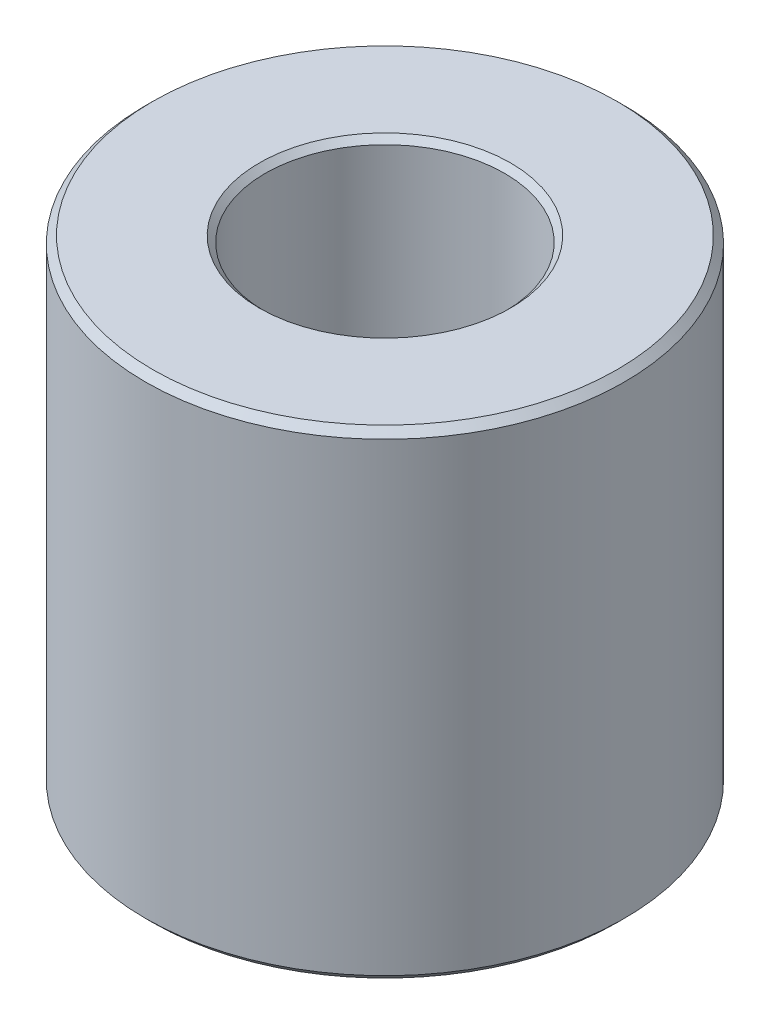
ISO-10303-21;
HEADER;
FILE_DESCRIPTION(('STEP AP214'),'2;1');
FILE_NAME('part.step','',(''),(''),'','','');
FILE_SCHEMA(('AUTOMOTIVE_DESIGN { 1 0 10303 214 1 1 1 1 }'));
ENDSEC;
DATA;
#1=APPLICATION_CONTEXT('core data for automotive mechanical design processes');
#2=APPLICATION_PROTOCOL_DEFINITION('international standard','automotive_design',2000,#1);
#3=PRODUCT_CONTEXT('',#1,'mechanical');
#4=PRODUCT('Part','Part','',(#3));
#5=PRODUCT_RELATED_PRODUCT_CATEGORY('part','',(#4));
#6=PRODUCT_DEFINITION_FORMATION('','',#4);
#7=PRODUCT_DEFINITION_CONTEXT('part definition',#1,'design');
#8=PRODUCT_DEFINITION('design','',#6,#7);
#9=PRODUCT_DEFINITION_SHAPE('','',#8);
#10=(LENGTH_UNIT() NAMED_UNIT(*) SI_UNIT(.MILLI.,.METRE.));
#11=(NAMED_UNIT(*) PLANE_ANGLE_UNIT() SI_UNIT($,.RADIAN.));
#12=(NAMED_UNIT(*) SI_UNIT($,.STERADIAN.) SOLID_ANGLE_UNIT());
#13=UNCERTAINTY_MEASURE_WITH_UNIT(LENGTH_MEASURE(1.E-05),#10,'distance_accuracy_value','');
#14=(GEOMETRIC_REPRESENTATION_CONTEXT(3) GLOBAL_UNCERTAINTY_ASSIGNED_CONTEXT((#13)) GLOBAL_UNIT_ASSIGNED_CONTEXT((#10,
#11,#12)) REPRESENTATION_CONTEXT('',''));
#15=CARTESIAN_POINT('',(0.,0.,0.));
#16=DIRECTION('',(0.,0.,1.));
#17=DIRECTION('',(1.,0.,0.));
#18=AXIS2_PLACEMENT_3D('',#15,#16,#17);
#19=CARTESIAN_POINT('',(0.,50.8,0.));
#20=DIRECTION('',(0.,-1.,0.));
#21=DIRECTION('',(0.,0.,-1.));
#22=AXIS2_PLACEMENT_3D('',#19,#20,#21);
#23=CYLINDRICAL_SURFACE('',#22,25.4);
#24=CARTESIAN_POINT('',(0.,0.761999999999985,0.));
#25=DIRECTION('',(0.,1.,0.));
#26=DIRECTION('',(0.,0.,1.));
#27=AXIS2_PLACEMENT_3D('',#24,#25,#26);
#28=CIRCLE('',#27,25.4);
#29=CARTESIAN_POINT('',(0.,0.761999999999985,25.4000000000001));
#30=VERTEX_POINT('',#29);
#31=EDGE_CURVE('E57',#30,#30,#28,.T.);
#32=ORIENTED_EDGE('',*,*,#31,.T.);
#33=EDGE_LOOP('',(#32));
#34=FACE_BOUND('',#33,.T.);
#35=CARTESIAN_POINT('',(0.,50.038,0.));
#36=DIRECTION('',(0.,1.,0.));
#37=DIRECTION('',(0.,0.,1.));
#38=AXIS2_PLACEMENT_3D('',#35,#36,#37);
#39=CIRCLE('',#38,25.4);
#40=CARTESIAN_POINT('',(0.,50.038,25.4000000000001));
#41=VERTEX_POINT('',#40);
#42=EDGE_CURVE('E60',#41,#41,#39,.F.);
#43=ORIENTED_EDGE('',*,*,#42,.T.);
#44=EDGE_LOOP('',(#43));
#45=FACE_BOUND('',#44,.T.);
#46=ADVANCED_FACE('F30',(#34,#45),#23,.T.);
#47=CARTESIAN_POINT('',(0.,50.8,0.));
#48=DIRECTION('',(0.,1.,0.));
#49=DIRECTION('',(0.,0.,1.));
#50=AXIS2_PLACEMENT_3D('',#47,#48,#49);
#51=PLANE('',#50);
#52=CARTESIAN_POINT('',(0.,50.8,0.));
#53=DIRECTION('',(0.,1.,0.));
#54=DIRECTION('',(0.,0.,1.));
#55=AXIS2_PLACEMENT_3D('',#52,#53,#54);
#56=CIRCLE('',#55,13.335);
#57=CARTESIAN_POINT('',(0.,50.8,13.335));
#58=VERTEX_POINT('',#57);
#59=EDGE_CURVE('E10',#58,#58,#56,.F.);
#60=ORIENTED_EDGE('',*,*,#59,.T.);
#61=EDGE_LOOP('',(#60));
#62=FACE_BOUND('',#61,.T.);
#63=CARTESIAN_POINT('',(0.,50.8,0.));
#64=DIRECTION('',(0.,1.,0.));
#65=DIRECTION('',(0.,0.,1.));
#66=AXIS2_PLACEMENT_3D('',#63,#64,#65);
#67=CIRCLE('',#66,24.638);
#68=CARTESIAN_POINT('',(0.,50.8,24.6380000000001));
#69=VERTEX_POINT('',#68);
#70=EDGE_CURVE('E50',#69,#69,#67,.T.);
#71=ORIENTED_EDGE('',*,*,#70,.T.);
#72=EDGE_LOOP('',(#71));
#73=FACE_BOUND('',#72,.T.);
#74=ADVANCED_FACE('F84',(#62,#73),#51,.T.);
#75=CARTESIAN_POINT('',(0.,0.,0.));
#76=DIRECTION('',(0.,1.,0.));
#77=DIRECTION('',(0.,0.,1.));
#78=AXIS2_PLACEMENT_3D('',#75,#76,#77);
#79=PLANE('',#78);
#80=CARTESIAN_POINT('',(0.,0.,0.));
#81=DIRECTION('',(0.,1.,0.));
#82=DIRECTION('',(0.,0.,1.));
#83=AXIS2_PLACEMENT_3D('',#80,#81,#82);
#84=CIRCLE('',#83,7.12469999999999);
#85=CARTESIAN_POINT('',(0.,0.,7.12470000000001));
#86=VERTEX_POINT('',#85);
#87=EDGE_CURVE('E66',#86,#86,#84,.T.);
#88=ORIENTED_EDGE('',*,*,#87,.T.);
#89=EDGE_LOOP('',(#88));
#90=FACE_BOUND('',#89,.T.);
#91=CARTESIAN_POINT('',(0.,0.,0.));
#92=DIRECTION('',(0.,1.,0.));
#93=DIRECTION('',(0.,0.,1.));
#94=AXIS2_PLACEMENT_3D('',#91,#92,#93);
#95=CIRCLE('',#94,24.638);
#96=CARTESIAN_POINT('',(0.,0.,24.6380000000001));
#97=VERTEX_POINT('',#96);
#98=EDGE_CURVE('E54',#97,#97,#95,.F.);
#99=ORIENTED_EDGE('',*,*,#98,.T.);
#100=EDGE_LOOP('',(#99));
#101=FACE_BOUND('',#100,.T.);
#102=ADVANCED_FACE('F72',(#90,#101),#79,.F.);
#103=CARTESIAN_POINT('',(0.,50.8,0.));
#104=DIRECTION('',(0.,1.,0.));
#105=DIRECTION('',(0.,0.,1.));
#106=AXIS2_PLACEMENT_3D('',#103,#104,#105);
#107=CYLINDRICAL_SURFACE('',#106,6.36269999999999);
#108=CARTESIAN_POINT('',(0.,7.87400000000001,0.));
#109=DIRECTION('',(0.,-1.,0.));
#110=DIRECTION('',(0.,0.,-1.));
#111=AXIS2_PLACEMENT_3D('',#108,#109,#110);
#112=CIRCLE('',#111,6.36269999999999);
#113=CARTESIAN_POINT('',(0.,7.87400000000001,-6.36270000000001));
#114=VERTEX_POINT('',#113);
#115=EDGE_CURVE('E51',#114,#114,#112,.F.);
#116=ORIENTED_EDGE('',*,*,#115,.T.);
#117=EDGE_LOOP('',(#116));
#118=FACE_BOUND('',#117,.T.);
#119=CARTESIAN_POINT('',(0.,0.762000000000013,0.));
#120=DIRECTION('',(0.,1.,0.));
#121=DIRECTION('',(0.,0.,1.));
#122=AXIS2_PLACEMENT_3D('',#119,#120,#121);
#123=CIRCLE('',#122,6.36269999999999);
#124=CARTESIAN_POINT('',(0.,0.762000000000013,6.36270000000001));
#125=VERTEX_POINT('',#124);
#126=EDGE_CURVE('E63',#125,#125,#123,.F.);
#127=ORIENTED_EDGE('',*,*,#126,.T.);
#128=EDGE_LOOP('',(#127));
#129=FACE_BOUND('',#128,.T.);
#130=ADVANCED_FACE('F99',(#118,#129),#107,.F.);
#131=CARTESIAN_POINT('',(0.,0.,0.));
#132=DIRECTION('',(0.,-1.,0.));
#133=DIRECTION('',(0.,0.,-1.));
#134=AXIS2_PLACEMENT_3D('',#131,#132,#133);
#135=CONICAL_SURFACE('',#134,7.12469999999999,0.785398163397439);
#136=ORIENTED_EDGE('',*,*,#126,.F.);
#137=EDGE_LOOP('',(#136));
#138=FACE_BOUND('',#137,.T.);
#139=ORIENTED_EDGE('',*,*,#87,.F.);
#140=EDGE_LOOP('',(#139));
#141=FACE_BOUND('',#140,.T.);
#142=ADVANCED_FACE('F78',(#138,#141),#135,.F.);
#143=CARTESIAN_POINT('',(0.,0.761999999999985,0.));
#144=DIRECTION('',(0.,1.,0.));
#145=DIRECTION('',(0.,0.,1.));
#146=AXIS2_PLACEMENT_3D('',#143,#144,#145);
#147=CONICAL_SURFACE('',#146,25.4,0.785398163397451);
#148=ORIENTED_EDGE('',*,*,#98,.F.);
#149=EDGE_LOOP('',(#148));
#150=FACE_BOUND('',#149,.T.);
#151=ORIENTED_EDGE('',*,*,#31,.F.);
#152=EDGE_LOOP('',(#151));
#153=FACE_BOUND('',#152,.T.);
#154=ADVANCED_FACE('F74',(#150,#153),#147,.T.);
#155=CARTESIAN_POINT('',(0.,50.8,0.));
#156=DIRECTION('',(0.,-1.,0.));
#157=DIRECTION('',(0.,0.,-1.));
#158=AXIS2_PLACEMENT_3D('',#155,#156,#157);
#159=CONICAL_SURFACE('',#158,24.638,0.785398163397453);
#160=ORIENTED_EDGE('',*,*,#42,.F.);
#161=EDGE_LOOP('',(#160));
#162=FACE_BOUND('',#161,.T.);
#163=ORIENTED_EDGE('',*,*,#70,.F.);
#164=EDGE_LOOP('',(#163));
#165=FACE_BOUND('',#164,.T.);
#166=ADVANCED_FACE('F77',(#162,#165),#159,.T.);
#167=CARTESIAN_POINT('',(0.,7.87400000000001,0.));
#168=DIRECTION('',(0.,-1.,0.));
#169=DIRECTION('',(0.,0.,-1.));
#170=AXIS2_PLACEMENT_3D('',#167,#168,#169);
#171=PLANE('',#170);
#172=CARTESIAN_POINT('',(0.,7.87400000000001,0.));
#173=DIRECTION('',(0.,-1.,0.));
#174=DIRECTION('',(0.,0.,-1.));
#175=AXIS2_PLACEMENT_3D('',#172,#173,#174);
#176=CIRCLE('',#175,12.446);
#177=CARTESIAN_POINT('',(0.,7.87400000000001,-12.446));
#178=VERTEX_POINT('',#177);
#179=EDGE_CURVE('E45',#178,#178,#176,.F.);
#180=ORIENTED_EDGE('',*,*,#179,.T.);
#181=EDGE_LOOP('',(#180));
#182=FACE_BOUND('',#181,.T.);
#183=ORIENTED_EDGE('',*,*,#115,.F.);
#184=EDGE_LOOP('',(#183));
#185=FACE_BOUND('',#184,.T.);
#186=ADVANCED_FACE('F90',(#182,#185),#171,.F.);
#187=CARTESIAN_POINT('',(0.,50.8,0.));
#188=DIRECTION('',(0.,1.,0.));
#189=DIRECTION('',(0.,0.,1.));
#190=AXIS2_PLACEMENT_3D('',#187,#188,#189);
#191=CYLINDRICAL_SURFACE('',#190,12.7);
#192=CARTESIAN_POINT('',(0.,50.165,0.));
#193=DIRECTION('',(0.,1.,0.));
#194=DIRECTION('',(0.,0.,1.));
#195=AXIS2_PLACEMENT_3D('',#192,#193,#194);
#196=CIRCLE('',#195,12.7);
#197=CARTESIAN_POINT('',(0.,50.165,12.7));
#198=VERTEX_POINT('',#197);
#199=EDGE_CURVE('E37',#198,#198,#196,.T.);
#200=ORIENTED_EDGE('',*,*,#199,.T.);
#201=EDGE_LOOP('',(#200));
#202=FACE_BOUND('',#201,.T.);
#203=CARTESIAN_POINT('',(0.,8.12799999999998,0.));
#204=DIRECTION('',(0.,-1.,0.));
#205=DIRECTION('',(0.,0.,-1.));
#206=AXIS2_PLACEMENT_3D('',#203,#204,#205);
#207=CIRCLE('',#206,12.7);
#208=CARTESIAN_POINT('',(0.,8.12799999999998,-12.7));
#209=VERTEX_POINT('',#208);
#210=EDGE_CURVE('E41',#209,#209,#207,.T.);
#211=ORIENTED_EDGE('',*,*,#210,.T.);
#212=EDGE_LOOP('',(#211));
#213=FACE_BOUND('',#212,.T.);
#214=ADVANCED_FACE('F109',(#202,#213),#191,.F.);
#215=CARTESIAN_POINT('',(0.,7.87400000000001,0.));
#216=DIRECTION('',(0.,1.,0.));
#217=DIRECTION('',(0.,0.,1.));
#218=AXIS2_PLACEMENT_3D('',#215,#216,#217);
#219=CONICAL_SURFACE('',#218,12.446,0.785398163397482);
#220=ORIENTED_EDGE('',*,*,#210,.F.);
#221=EDGE_LOOP('',(#220));
#222=FACE_BOUND('',#221,.T.);
#223=ORIENTED_EDGE('',*,*,#179,.F.);
#224=EDGE_LOOP('',(#223));
#225=FACE_BOUND('',#224,.T.);
#226=ADVANCED_FACE('F107',(#222,#225),#219,.F.);
#227=CARTESIAN_POINT('',(0.,50.165,0.));
#228=DIRECTION('',(0.,1.,0.));
#229=DIRECTION('',(0.,0.,1.));
#230=AXIS2_PLACEMENT_3D('',#227,#228,#229);
#231=CONICAL_SURFACE('',#230,12.7,0.785398163397446);
#232=ORIENTED_EDGE('',*,*,#59,.F.);
#233=EDGE_LOOP('',(#232));
#234=FACE_BOUND('',#233,.T.);
#235=ORIENTED_EDGE('',*,*,#199,.F.);
#236=EDGE_LOOP('',(#235));
#237=FACE_BOUND('',#236,.T.);
#238=ADVANCED_FACE('F32',(#234,#237),#231,.F.);
#239=CLOSED_SHELL('',(#46,#74,#102,#130,#142,#154,#166,#186,#214,#226,#238));
#240=MANIFOLD_SOLID_BREP('B2',#239);
#241=ADVANCED_BREP_SHAPE_REPRESENTATION('',(#18,#240),#14);
#242=SHAPE_DEFINITION_REPRESENTATION(#9,#241);
ENDSEC;
END-ISO-10303-21;
